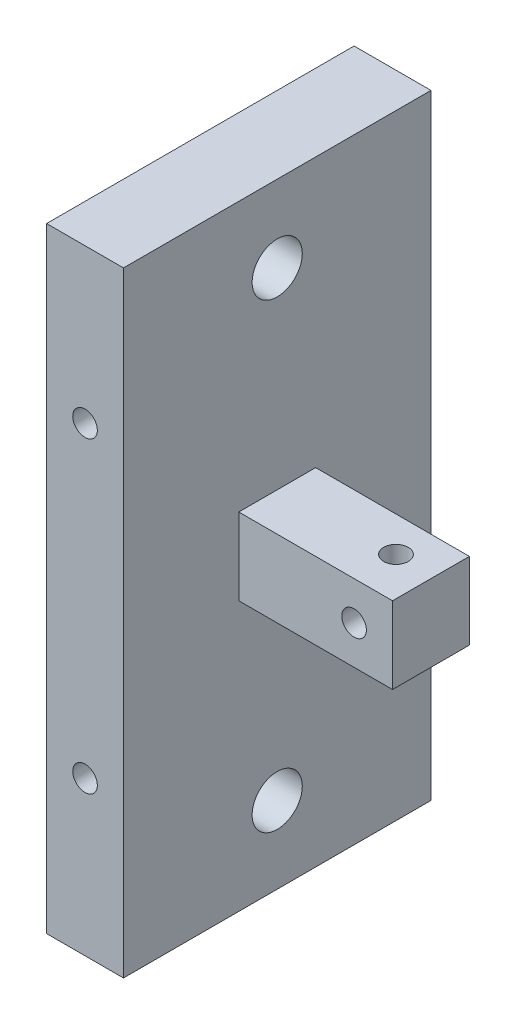
ISO-10303-21;
HEADER;
FILE_DESCRIPTION(('STEP AP214'),'2;1');
FILE_NAME('part.step','',(''),(''),'','','');
FILE_SCHEMA(('AUTOMOTIVE_DESIGN { 1 0 10303 214 1 1 1 1 }'));
ENDSEC;
DATA;
#1=APPLICATION_CONTEXT('core data for automotive mechanical design processes');
#2=APPLICATION_PROTOCOL_DEFINITION('international standard','automotive_design',2000,#1);
#3=PRODUCT_CONTEXT('',#1,'mechanical');
#4=PRODUCT('Part','Part','',(#3));
#5=PRODUCT_RELATED_PRODUCT_CATEGORY('part','',(#4));
#6=PRODUCT_DEFINITION_FORMATION('','',#4);
#7=PRODUCT_DEFINITION_CONTEXT('part definition',#1,'design');
#8=PRODUCT_DEFINITION('design','',#6,#7);
#9=PRODUCT_DEFINITION_SHAPE('','',#8);
#10=(LENGTH_UNIT() NAMED_UNIT(*) SI_UNIT(.MILLI.,.METRE.));
#11=(NAMED_UNIT(*) PLANE_ANGLE_UNIT() SI_UNIT($,.RADIAN.));
#12=(NAMED_UNIT(*) SI_UNIT($,.STERADIAN.) SOLID_ANGLE_UNIT());
#13=UNCERTAINTY_MEASURE_WITH_UNIT(LENGTH_MEASURE(1.E-05),#10,'distance_accuracy_value','');
#14=(GEOMETRIC_REPRESENTATION_CONTEXT(3) GLOBAL_UNCERTAINTY_ASSIGNED_CONTEXT((#13)) GLOBAL_UNIT_ASSIGNED_CONTEXT((#10,
#11,#12)) REPRESENTATION_CONTEXT('',''));
#15=CARTESIAN_POINT('',(0.,0.,0.));
#16=DIRECTION('',(0.,0.,1.));
#17=DIRECTION('',(1.,0.,0.));
#18=AXIS2_PLACEMENT_3D('',#15,#16,#17);
#19=CARTESIAN_POINT('',(25.,721.739130434782,1081.08695652174));
#20=DIRECTION('',(0.,0.,-1.));
#21=DIRECTION('',(-1.,0.,0.));
#22=AXIS2_PLACEMENT_3D('',#19,#20,#21);
#23=CYLINDRICAL_SURFACE('',#22,1.59999999999999);
#24=CARTESIAN_POINT('',(25.,721.739130434782,1081.08695652174));
#25=DIRECTION('',(0.,0.,-1.));
#26=DIRECTION('',(-1.,0.,0.));
#27=AXIS2_PLACEMENT_3D('',#24,#25,#26);
#28=CIRCLE('',#27,1.59999999999999);
#29=CARTESIAN_POINT('',(23.4,721.739130434782,1081.08695652174));
#30=VERTEX_POINT('',#29);
#31=EDGE_CURVE('E243',#30,#30,#28,.T.);
#32=ORIENTED_EDGE('',*,*,#31,.T.);
#33=EDGE_LOOP('',(#32));
#34=FACE_BOUND('',#33,.T.);
#35=CARTESIAN_POINT('',(25.,721.739130434782,1085.63973923246));
#36=DIRECTION('',(0.,-0.707106781186547,-0.707106781186547));
#37=DIRECTION('',(0.,0.707106781186547,-0.707106781186547));
#38=AXIS2_PLACEMENT_3D('',#35,#36,#37);
#39=ELLIPSE('',#38,2.26274169979694,1.59999999999999);
#40=CARTESIAN_POINT('',(26.6,721.739130434782,1085.63973923246));
#41=VERTEX_POINT('',#40);
#42=CARTESIAN_POINT('',(23.4,721.739130434782,1085.63973923246));
#43=VERTEX_POINT('',#42);
#44=EDGE_CURVE('E53',#41,#43,#39,.F.);
#45=ORIENTED_EDGE('',*,*,#44,.T.);
#46=CARTESIAN_POINT('',(25.,721.739130434782,1085.63973923246));
#47=DIRECTION('',(0.,0.707106781186547,-0.707106781186547));
#48=DIRECTION('',(0.,-0.707106781186547,-0.707106781186547));
#49=AXIS2_PLACEMENT_3D('',#46,#47,#48);
#50=ELLIPSE('',#49,2.26274169979694,1.59999999999999);
#51=EDGE_CURVE('E11',#43,#41,#50,.F.);
#52=ORIENTED_EDGE('',*,*,#51,.T.);
#53=EDGE_LOOP('',(#45,#52));
#54=FACE_BOUND('',#53,.T.);
#55=ADVANCED_FACE('F39',(#34,#54),#23,.F.);
#56=CARTESIAN_POINT('',(10.,0.,0.));
#57=DIRECTION('',(1.,0.,0.));
#58=DIRECTION('',(0.,0.,-1.));
#59=AXIS2_PLACEMENT_3D('',#56,#57,#58);
#60=PLANE('',#59);
#61=CARTESIAN_POINT('',(10.,751.739130434783,1086.08695652174));
#62=DIRECTION('',(1.,0.,0.));
#63=DIRECTION('',(0.,0.,-1.));
#64=AXIS2_PLACEMENT_3D('',#61,#62,#63);
#65=CIRCLE('',#64,3.26389999999999);
#66=CARTESIAN_POINT('',(10.,751.739130434783,1082.82305652174));
#67=VERTEX_POINT('',#66);
#68=EDGE_CURVE('E132',#67,#67,#65,.T.);
#69=ORIENTED_EDGE('',*,*,#68,.F.);
#70=EDGE_LOOP('',(#69));
#71=FACE_BOUND('',#70,.T.);
#72=CARTESIAN_POINT('',(10.,691.739130434783,1086.08695652174));
#73=DIRECTION('',(1.,0.,0.));
#74=DIRECTION('',(0.,0.,-1.));
#75=AXIS2_PLACEMENT_3D('',#72,#73,#74);
#76=CIRCLE('',#75,3.26389999999999);
#77=CARTESIAN_POINT('',(10.,691.739130434783,1082.82305652174));
#78=VERTEX_POINT('',#77);
#79=EDGE_CURVE('E131',#78,#78,#76,.T.);
#80=ORIENTED_EDGE('',*,*,#79,.F.);
#81=EDGE_LOOP('',(#80));
#82=FACE_BOUND('',#81,.T.);
#83=DIRECTION('',(0.,-1.,0.));
#84=VECTOR('',#83,1.);
#85=CARTESIAN_POINT('',(10.,761.739130434783,1106.08695652174));
#86=LINE('',#85,#84);
#87=CARTESIAN_POINT('',(10.,761.739130434783,1106.08695652174));
#88=VERTEX_POINT('',#87);
#89=CARTESIAN_POINT('',(10.,681.739130434783,1106.08695652174));
#90=VERTEX_POINT('',#89);
#91=EDGE_CURVE('E152',#88,#90,#86,.T.);
#92=ORIENTED_EDGE('',*,*,#91,.T.);
#93=DIRECTION('',(0.,0.,-1.));
#94=VECTOR('',#93,1.);
#95=CARTESIAN_POINT('',(10.,681.739130434783,1106.08695652174));
#96=LINE('',#95,#94);
#97=CARTESIAN_POINT('',(10.,681.739130434783,1066.08695652174));
#98=VERTEX_POINT('',#97);
#99=EDGE_CURVE('E169',#90,#98,#96,.T.);
#100=ORIENTED_EDGE('',*,*,#99,.T.);
#101=DIRECTION('',(0.,1.,0.));
#102=VECTOR('',#101,1.);
#103=CARTESIAN_POINT('',(10.,761.739130434783,1066.08695652174));
#104=LINE('',#103,#102);
#105=CARTESIAN_POINT('',(10.,761.739130434783,1066.08695652174));
#106=VERTEX_POINT('',#105);
#107=EDGE_CURVE('E166',#98,#106,#104,.T.);
#108=ORIENTED_EDGE('',*,*,#107,.T.);
#109=DIRECTION('',(0.,0.,1.));
#110=VECTOR('',#109,1.);
#111=CARTESIAN_POINT('',(10.,761.739130434783,1106.08695652174));
#112=LINE('',#111,#110);
#113=EDGE_CURVE('E148',#106,#88,#112,.T.);
#114=ORIENTED_EDGE('',*,*,#113,.T.);
#115=EDGE_LOOP('',(#92,#100,#108,#114));
#116=FACE_BOUND('',#115,.T.);
#117=DIRECTION('',(0.,0.,-1.));
#118=VECTOR('',#117,1.);
#119=CARTESIAN_POINT('',(10.,716.739130434782,1091.08695652174));
#120=LINE('',#119,#118);
#121=CARTESIAN_POINT('',(10.,716.739130434782,1091.08695652174));
#122=VERTEX_POINT('',#121);
#123=CARTESIAN_POINT('',(10.,716.739130434782,1081.08695652174));
#124=VERTEX_POINT('',#123);
#125=EDGE_CURVE('E195',#122,#124,#120,.T.);
#126=ORIENTED_EDGE('',*,*,#125,.F.);
#127=DIRECTION('',(0.,-1.,0.));
#128=VECTOR('',#127,1.);
#129=CARTESIAN_POINT('',(10.,726.739130434782,1091.08695652174));
#130=LINE('',#129,#128);
#131=CARTESIAN_POINT('',(10.,726.739130434782,1091.08695652174));
#132=VERTEX_POINT('',#131);
#133=EDGE_CURVE('E198',#132,#122,#130,.T.);
#134=ORIENTED_EDGE('',*,*,#133,.F.);
#135=DIRECTION('',(0.,0.,1.));
#136=VECTOR('',#135,1.);
#137=CARTESIAN_POINT('',(10.,726.739130434782,1091.08695652174));
#138=LINE('',#137,#136);
#139=CARTESIAN_POINT('',(10.,726.739130434782,1081.08695652174));
#140=VERTEX_POINT('',#139);
#141=EDGE_CURVE('E188',#140,#132,#138,.T.);
#142=ORIENTED_EDGE('',*,*,#141,.F.);
#143=DIRECTION('',(0.,1.,0.));
#144=VECTOR('',#143,1.);
#145=CARTESIAN_POINT('',(10.,726.739130434782,1081.08695652174));
#146=LINE('',#145,#144);
#147=EDGE_CURVE('E192',#124,#140,#146,.T.);
#148=ORIENTED_EDGE('',*,*,#147,.F.);
#149=EDGE_LOOP('',(#126,#134,#142,#148));
#150=FACE_BOUND('',#149,.T.);
#151=ADVANCED_FACE('F272',(#71,#82,#116,#150),#60,.T.);
#152=CARTESIAN_POINT('',(10.,761.739130434783,1106.08695652174));
#153=DIRECTION('',(0.,0.,-1.));
#154=DIRECTION('',(-1.,0.,0.));
#155=AXIS2_PLACEMENT_3D('',#152,#153,#154);
#156=PLANE('',#155);
#157=CARTESIAN_POINT('',(5.,701.739130434783,1106.08695652174));
#158=DIRECTION('',(0.,0.,-1.));
#159=DIRECTION('',(-1.,0.,0.));
#160=AXIS2_PLACEMENT_3D('',#157,#158,#159);
#161=CIRCLE('',#160,1.59999999999999);
#162=CARTESIAN_POINT('',(3.40000000000001,701.739130434783,1106.08695652174));
#163=VERTEX_POINT('',#162);
#164=EDGE_CURVE('E231',#163,#163,#161,.T.);
#165=ORIENTED_EDGE('',*,*,#164,.T.);
#166=EDGE_LOOP('',(#165));
#167=FACE_BOUND('',#166,.T.);
#168=CARTESIAN_POINT('',(5.,741.739130434783,1106.08695652174));
#169=DIRECTION('',(0.,0.,-1.));
#170=DIRECTION('',(-1.,0.,0.));
#171=AXIS2_PLACEMENT_3D('',#168,#169,#170);
#172=CIRCLE('',#171,1.59999999999999);
#173=CARTESIAN_POINT('',(3.40000000000001,741.739130434783,1106.08695652174));
#174=VERTEX_POINT('',#173);
#175=EDGE_CURVE('E223',#174,#174,#172,.T.);
#176=ORIENTED_EDGE('',*,*,#175,.T.);
#177=EDGE_LOOP('',(#176));
#178=FACE_BOUND('',#177,.T.);
#179=DIRECTION('',(0.,-1.,0.));
#180=VECTOR('',#179,1.);
#181=CARTESIAN_POINT('',(0.,761.739130434783,1106.08695652174));
#182=LINE('',#181,#180);
#183=CARTESIAN_POINT('',(0.,761.739130434783,1106.08695652174));
#184=VERTEX_POINT('',#183);
#185=CARTESIAN_POINT('',(0.,681.739130434783,1106.08695652174));
#186=VERTEX_POINT('',#185);
#187=EDGE_CURVE('E159',#184,#186,#182,.T.);
#188=ORIENTED_EDGE('',*,*,#187,.T.);
#189=DIRECTION('',(-1.,0.,0.));
#190=VECTOR('',#189,1.);
#191=CARTESIAN_POINT('',(10.,681.739130434783,1106.08695652174));
#192=LINE('',#191,#190);
#193=EDGE_CURVE('E121',#90,#186,#192,.T.);
#194=ORIENTED_EDGE('',*,*,#193,.F.);
#195=ORIENTED_EDGE('',*,*,#91,.F.);
#196=DIRECTION('',(-1.,0.,0.));
#197=VECTOR('',#196,1.);
#198=CARTESIAN_POINT('',(10.,761.739130434783,1106.08695652174));
#199=LINE('',#198,#197);
#200=EDGE_CURVE('E144',#88,#184,#199,.T.);
#201=ORIENTED_EDGE('',*,*,#200,.T.);
#202=EDGE_LOOP('',(#188,#194,#195,#201));
#203=FACE_BOUND('',#202,.T.);
#204=ADVANCED_FACE('F41',(#167,#178,#203),#156,.F.);
#205=CARTESIAN_POINT('',(10.,681.739130434783,1106.08695652174));
#206=DIRECTION('',(0.,1.,0.));
#207=DIRECTION('',(0.,0.,1.));
#208=AXIS2_PLACEMENT_3D('',#205,#206,#207);
#209=PLANE('',#208);
#210=DIRECTION('',(0.,0.,-1.));
#211=VECTOR('',#210,1.);
#212=CARTESIAN_POINT('',(0.,681.739130434783,1106.08695652174));
#213=LINE('',#212,#211);
#214=CARTESIAN_POINT('',(0.,681.739130434783,1066.08695652174));
#215=VERTEX_POINT('',#214);
#216=EDGE_CURVE('E156',#186,#215,#213,.T.);
#217=ORIENTED_EDGE('',*,*,#216,.T.);
#218=DIRECTION('',(-1.,0.,0.));
#219=VECTOR('',#218,1.);
#220=CARTESIAN_POINT('',(10.,681.739130434783,1066.08695652174));
#221=LINE('',#220,#219);
#222=EDGE_CURVE('E136',#98,#215,#221,.T.);
#223=ORIENTED_EDGE('',*,*,#222,.F.);
#224=ORIENTED_EDGE('',*,*,#99,.F.);
#225=ORIENTED_EDGE('',*,*,#193,.T.);
#226=EDGE_LOOP('',(#217,#223,#224,#225));
#227=FACE_BOUND('',#226,.T.);
#228=ADVANCED_FACE('F344',(#227),#209,.F.);
#229=CARTESIAN_POINT('',(10.,761.739130434783,1066.08695652174));
#230=DIRECTION('',(0.,0.,1.));
#231=DIRECTION('',(1.,0.,0.));
#232=AXIS2_PLACEMENT_3D('',#229,#230,#231);
#233=PLANE('',#232);
#234=CARTESIAN_POINT('',(5.,701.739130434783,1066.08695652174));
#235=DIRECTION('',(0.,0.,-1.));
#236=DIRECTION('',(-1.,0.,0.));
#237=AXIS2_PLACEMENT_3D('',#234,#235,#236);
#238=CIRCLE('',#237,1.59999999999999);
#239=CARTESIAN_POINT('',(3.40000000000001,701.739130434783,1066.08695652174));
#240=VERTEX_POINT('',#239);
#241=EDGE_CURVE('E235',#240,#240,#238,.T.);
#242=ORIENTED_EDGE('',*,*,#241,.F.);
#243=EDGE_LOOP('',(#242));
#244=FACE_BOUND('',#243,.T.);
#245=CARTESIAN_POINT('',(5.,741.739130434783,1066.08695652174));
#246=DIRECTION('',(0.,0.,-1.));
#247=DIRECTION('',(-1.,0.,0.));
#248=AXIS2_PLACEMENT_3D('',#245,#246,#247);
#249=CIRCLE('',#248,1.59999999999999);
#250=CARTESIAN_POINT('',(3.40000000000001,741.739130434783,1066.08695652174));
#251=VERTEX_POINT('',#250);
#252=EDGE_CURVE('E227',#251,#251,#249,.T.);
#253=ORIENTED_EDGE('',*,*,#252,.F.);
#254=EDGE_LOOP('',(#253));
#255=FACE_BOUND('',#254,.T.);
#256=DIRECTION('',(0.,1.,0.));
#257=VECTOR('',#256,1.);
#258=CARTESIAN_POINT('',(0.,761.739130434783,1066.08695652174));
#259=LINE('',#258,#257);
#260=CARTESIAN_POINT('',(0.,761.739130434783,1066.08695652174));
#261=VERTEX_POINT('',#260);
#262=EDGE_CURVE('E153',#215,#261,#259,.T.);
#263=ORIENTED_EDGE('',*,*,#262,.T.);
#264=DIRECTION('',(-1.,0.,0.));
#265=VECTOR('',#264,1.);
#266=CARTESIAN_POINT('',(10.,761.739130434783,1066.08695652174));
#267=LINE('',#266,#265);
#268=EDGE_CURVE('E140',#106,#261,#267,.T.);
#269=ORIENTED_EDGE('',*,*,#268,.F.);
#270=ORIENTED_EDGE('',*,*,#107,.F.);
#271=ORIENTED_EDGE('',*,*,#222,.T.);
#272=EDGE_LOOP('',(#263,#269,#270,#271));
#273=FACE_BOUND('',#272,.T.);
#274=ADVANCED_FACE('F341',(#244,#255,#273),#233,.F.);
#275=CARTESIAN_POINT('',(10.,761.739130434783,1106.08695652174));
#276=DIRECTION('',(0.,-1.,0.));
#277=DIRECTION('',(0.,0.,-1.));
#278=AXIS2_PLACEMENT_3D('',#275,#276,#277);
#279=PLANE('',#278);
#280=DIRECTION('',(0.,0.,1.));
#281=VECTOR('',#280,1.);
#282=CARTESIAN_POINT('',(0.,761.739130434783,1106.08695652174));
#283=LINE('',#282,#281);
#284=EDGE_CURVE('E149',#261,#184,#283,.T.);
#285=ORIENTED_EDGE('',*,*,#284,.T.);
#286=ORIENTED_EDGE('',*,*,#200,.F.);
#287=ORIENTED_EDGE('',*,*,#113,.F.);
#288=ORIENTED_EDGE('',*,*,#268,.T.);
#289=EDGE_LOOP('',(#285,#286,#287,#288));
#290=FACE_BOUND('',#289,.T.);
#291=ADVANCED_FACE('F325',(#290),#279,.F.);
#292=CARTESIAN_POINT('',(0.,0.,0.));
#293=DIRECTION('',(1.,0.,0.));
#294=DIRECTION('',(0.,0.,-1.));
#295=AXIS2_PLACEMENT_3D('',#292,#293,#294);
#296=PLANE('',#295);
#297=CARTESIAN_POINT('',(0.,751.739130434783,1086.08695652174));
#298=DIRECTION('',(1.,0.,0.));
#299=DIRECTION('',(0.,0.,-1.));
#300=AXIS2_PLACEMENT_3D('',#297,#298,#299);
#301=CIRCLE('',#300,3.26389999999999);
#302=CARTESIAN_POINT('',(0.,751.739130434783,1082.82305652174));
#303=VERTEX_POINT('',#302);
#304=EDGE_CURVE('E127',#303,#303,#301,.T.);
#305=ORIENTED_EDGE('',*,*,#304,.T.);
#306=EDGE_LOOP('',(#305));
#307=FACE_BOUND('',#306,.T.);
#308=CARTESIAN_POINT('',(0.,691.739130434783,1086.08695652174));
#309=DIRECTION('',(1.,0.,0.));
#310=DIRECTION('',(0.,0.,-1.));
#311=AXIS2_PLACEMENT_3D('',#308,#309,#310);
#312=CIRCLE('',#311,3.26389999999999);
#313=CARTESIAN_POINT('',(0.,691.739130434783,1082.82305652174));
#314=VERTEX_POINT('',#313);
#315=EDGE_CURVE('E202',#314,#314,#312,.T.);
#316=ORIENTED_EDGE('',*,*,#315,.T.);
#317=EDGE_LOOP('',(#316));
#318=FACE_BOUND('',#317,.T.);
#319=ORIENTED_EDGE('',*,*,#187,.F.);
#320=ORIENTED_EDGE('',*,*,#284,.F.);
#321=ORIENTED_EDGE('',*,*,#262,.F.);
#322=ORIENTED_EDGE('',*,*,#216,.F.);
#323=EDGE_LOOP('',(#319,#320,#321,#322));
#324=FACE_BOUND('',#323,.T.);
#325=ADVANCED_FACE('F322',(#307,#318,#324),#296,.F.);
#326=CARTESIAN_POINT('',(30.,726.739130434782,1091.08695652174));
#327=DIRECTION('',(0.,0.,-1.));
#328=DIRECTION('',(-1.,0.,0.));
#329=AXIS2_PLACEMENT_3D('',#326,#327,#328);
#330=PLANE('',#329);
#331=CARTESIAN_POINT('',(25.,721.739130434782,1091.08695652174));
#332=DIRECTION('',(0.,0.,-1.));
#333=DIRECTION('',(-1.,0.,0.));
#334=AXIS2_PLACEMENT_3D('',#331,#332,#333);
#335=CIRCLE('',#334,1.59999999999999);
#336=CARTESIAN_POINT('',(23.4,721.739130434782,1091.08695652174));
#337=VERTEX_POINT('',#336);
#338=EDGE_CURVE('E239',#337,#337,#335,.T.);
#339=ORIENTED_EDGE('',*,*,#338,.T.);
#340=EDGE_LOOP('',(#339));
#341=FACE_BOUND('',#340,.T.);
#342=ORIENTED_EDGE('',*,*,#133,.T.);
#343=DIRECTION('',(-1.,0.,0.));
#344=VECTOR('',#343,1.);
#345=CARTESIAN_POINT('',(30.,716.739130434782,1091.08695652174));
#346=LINE('',#345,#344);
#347=CARTESIAN_POINT('',(30.,716.739130434782,1091.08695652174));
#348=VERTEX_POINT('',#347);
#349=EDGE_CURVE('E163',#348,#122,#346,.T.);
#350=ORIENTED_EDGE('',*,*,#349,.F.);
#351=DIRECTION('',(0.,-1.,0.));
#352=VECTOR('',#351,1.);
#353=CARTESIAN_POINT('',(30.,726.739130434782,1091.08695652174));
#354=LINE('',#353,#352);
#355=CARTESIAN_POINT('',(30.,726.739130434782,1091.08695652174));
#356=VERTEX_POINT('',#355);
#357=EDGE_CURVE('E191',#356,#348,#354,.T.);
#358=ORIENTED_EDGE('',*,*,#357,.F.);
#359=DIRECTION('',(-1.,0.,0.));
#360=VECTOR('',#359,1.);
#361=CARTESIAN_POINT('',(30.,726.739130434782,1091.08695652174));
#362=LINE('',#361,#360);
#363=EDGE_CURVE('E183',#356,#132,#362,.T.);
#364=ORIENTED_EDGE('',*,*,#363,.T.);
#365=EDGE_LOOP('',(#342,#350,#358,#364));
#366=FACE_BOUND('',#365,.T.);
#367=ADVANCED_FACE('F269',(#341,#366),#330,.F.);
#368=CARTESIAN_POINT('',(30.,716.739130434782,1091.08695652174));
#369=DIRECTION('',(0.,1.,0.));
#370=DIRECTION('',(0.,0.,1.));
#371=AXIS2_PLACEMENT_3D('',#368,#369,#370);
#372=PLANE('',#371);
#373=CARTESIAN_POINT('',(25.,716.739130434782,1085.63973923246));
#374=DIRECTION('',(0.,1.,0.));
#375=DIRECTION('',(0.,0.,1.));
#376=AXIS2_PLACEMENT_3D('',#373,#374,#375);
#377=CIRCLE('',#376,1.59999999999999);
#378=CARTESIAN_POINT('',(25.,716.739130434782,1087.23973923246));
#379=VERTEX_POINT('',#378);
#380=EDGE_CURVE('E247',#379,#379,#377,.T.);
#381=ORIENTED_EDGE('',*,*,#380,.T.);
#382=EDGE_LOOP('',(#381));
#383=FACE_BOUND('',#382,.T.);
#384=ORIENTED_EDGE('',*,*,#125,.T.);
#385=DIRECTION('',(-1.,0.,0.));
#386=VECTOR('',#385,1.);
#387=CARTESIAN_POINT('',(30.,716.739130434782,1081.08695652174));
#388=LINE('',#387,#386);
#389=CARTESIAN_POINT('',(30.,716.739130434782,1081.08695652174));
#390=VERTEX_POINT('',#389);
#391=EDGE_CURVE('E177',#390,#124,#388,.T.);
#392=ORIENTED_EDGE('',*,*,#391,.F.);
#393=DIRECTION('',(0.,0.,-1.));
#394=VECTOR('',#393,1.);
#395=CARTESIAN_POINT('',(30.,716.739130434782,1091.08695652174));
#396=LINE('',#395,#394);
#397=EDGE_CURVE('E208',#348,#390,#396,.T.);
#398=ORIENTED_EDGE('',*,*,#397,.F.);
#399=ORIENTED_EDGE('',*,*,#349,.T.);
#400=EDGE_LOOP('',(#384,#392,#398,#399));
#401=FACE_BOUND('',#400,.T.);
#402=ADVANCED_FACE('F275',(#383,#401),#372,.F.);
#403=CARTESIAN_POINT('',(30.,726.739130434782,1081.08695652174));
#404=DIRECTION('',(0.,0.,1.));
#405=DIRECTION('',(1.,0.,0.));
#406=AXIS2_PLACEMENT_3D('',#403,#404,#405);
#407=PLANE('',#406);
#408=ORIENTED_EDGE('',*,*,#31,.F.);
#409=EDGE_LOOP('',(#408));
#410=FACE_BOUND('',#409,.T.);
#411=ORIENTED_EDGE('',*,*,#147,.T.);
#412=DIRECTION('',(-1.,0.,0.));
#413=VECTOR('',#412,1.);
#414=CARTESIAN_POINT('',(30.,726.739130434782,1081.08695652174));
#415=LINE('',#414,#413);
#416=CARTESIAN_POINT('',(30.,726.739130434782,1081.08695652174));
#417=VERTEX_POINT('',#416);
#418=EDGE_CURVE('E61',#417,#140,#415,.T.);
#419=ORIENTED_EDGE('',*,*,#418,.F.);
#420=DIRECTION('',(0.,1.,0.));
#421=VECTOR('',#420,1.);
#422=CARTESIAN_POINT('',(30.,726.739130434782,1081.08695652174));
#423=LINE('',#422,#421);
#424=EDGE_CURVE('E205',#390,#417,#423,.T.);
#425=ORIENTED_EDGE('',*,*,#424,.F.);
#426=ORIENTED_EDGE('',*,*,#391,.T.);
#427=EDGE_LOOP('',(#411,#419,#425,#426));
#428=FACE_BOUND('',#427,.T.);
#429=ADVANCED_FACE('F260',(#410,#428),#407,.F.);
#430=CARTESIAN_POINT('',(30.,726.739130434782,1091.08695652174));
#431=DIRECTION('',(0.,-1.,0.));
#432=DIRECTION('',(0.,0.,-1.));
#433=AXIS2_PLACEMENT_3D('',#430,#431,#432);
#434=PLANE('',#433);
#435=CARTESIAN_POINT('',(25.,726.739130434782,1085.63973923246));
#436=DIRECTION('',(0.,1.,0.));
#437=DIRECTION('',(0.,0.,1.));
#438=AXIS2_PLACEMENT_3D('',#435,#436,#437);
#439=CIRCLE('',#438,1.59999999999999);
#440=CARTESIAN_POINT('',(25.,726.739130434782,1087.23973923246));
#441=VERTEX_POINT('',#440);
#442=EDGE_CURVE('E251',#441,#441,#439,.T.);
#443=ORIENTED_EDGE('',*,*,#442,.F.);
#444=EDGE_LOOP('',(#443));
#445=FACE_BOUND('',#444,.T.);
#446=ORIENTED_EDGE('',*,*,#141,.T.);
#447=ORIENTED_EDGE('',*,*,#363,.F.);
#448=DIRECTION('',(0.,0.,1.));
#449=VECTOR('',#448,1.);
#450=CARTESIAN_POINT('',(30.,726.739130434782,1091.08695652174));
#451=LINE('',#450,#449);
#452=EDGE_CURVE('E187',#417,#356,#451,.T.);
#453=ORIENTED_EDGE('',*,*,#452,.F.);
#454=ORIENTED_EDGE('',*,*,#418,.T.);
#455=EDGE_LOOP('',(#446,#447,#453,#454));
#456=FACE_BOUND('',#455,.T.);
#457=ADVANCED_FACE('F257',(#445,#456),#434,.F.);
#458=CARTESIAN_POINT('',(30.,0.,0.));
#459=DIRECTION('',(1.,0.,0.));
#460=DIRECTION('',(0.,0.,-1.));
#461=AXIS2_PLACEMENT_3D('',#458,#459,#460);
#462=PLANE('',#461);
#463=ORIENTED_EDGE('',*,*,#357,.T.);
#464=ORIENTED_EDGE('',*,*,#397,.T.);
#465=ORIENTED_EDGE('',*,*,#424,.T.);
#466=ORIENTED_EDGE('',*,*,#452,.T.);
#467=EDGE_LOOP('',(#463,#464,#465,#466));
#468=FACE_BOUND('',#467,.T.);
#469=ADVANCED_FACE('F259',(#468),#462,.T.);
#470=CARTESIAN_POINT('',(10.,691.739130434783,1086.08695652174));
#471=DIRECTION('',(1.,0.,0.));
#472=DIRECTION('',(0.,0.,-1.));
#473=AXIS2_PLACEMENT_3D('',#470,#471,#472);
#474=CYLINDRICAL_SURFACE('',#473,3.26389999999999);
#475=ORIENTED_EDGE('',*,*,#79,.T.);
#476=EDGE_LOOP('',(#475));
#477=FACE_BOUND('',#476,.T.);
#478=ORIENTED_EDGE('',*,*,#315,.F.);
#479=EDGE_LOOP('',(#478));
#480=FACE_BOUND('',#479,.T.);
#481=ADVANCED_FACE('F280',(#477,#480),#474,.F.);
#482=CARTESIAN_POINT('',(10.,751.739130434783,1086.08695652174));
#483=DIRECTION('',(1.,0.,0.));
#484=DIRECTION('',(0.,0.,-1.));
#485=AXIS2_PLACEMENT_3D('',#482,#483,#484);
#486=CYLINDRICAL_SURFACE('',#485,3.26389999999999);
#487=ORIENTED_EDGE('',*,*,#68,.T.);
#488=EDGE_LOOP('',(#487));
#489=FACE_BOUND('',#488,.T.);
#490=ORIENTED_EDGE('',*,*,#304,.F.);
#491=EDGE_LOOP('',(#490));
#492=FACE_BOUND('',#491,.T.);
#493=ADVANCED_FACE('F285',(#489,#492),#486,.F.);
#494=CARTESIAN_POINT('',(5.,741.739130434783,1066.08695652174));
#495=DIRECTION('',(0.,0.,-1.));
#496=DIRECTION('',(-1.,0.,0.));
#497=AXIS2_PLACEMENT_3D('',#494,#495,#496);
#498=CYLINDRICAL_SURFACE('',#497,1.59999999999999);
#499=ORIENTED_EDGE('',*,*,#175,.F.);
#500=EDGE_LOOP('',(#499));
#501=FACE_BOUND('',#500,.T.);
#502=ORIENTED_EDGE('',*,*,#252,.T.);
#503=EDGE_LOOP('',(#502));
#504=FACE_BOUND('',#503,.T.);
#505=ADVANCED_FACE('F304',(#501,#504),#498,.F.);
#506=CARTESIAN_POINT('',(5.,701.739130434783,1066.08695652174));
#507=DIRECTION('',(0.,0.,-1.));
#508=DIRECTION('',(-1.,0.,0.));
#509=AXIS2_PLACEMENT_3D('',#506,#507,#508);
#510=CYLINDRICAL_SURFACE('',#509,1.59999999999999);
#511=ORIENTED_EDGE('',*,*,#164,.F.);
#512=EDGE_LOOP('',(#511));
#513=FACE_BOUND('',#512,.T.);
#514=ORIENTED_EDGE('',*,*,#241,.T.);
#515=EDGE_LOOP('',(#514));
#516=FACE_BOUND('',#515,.T.);
#517=ADVANCED_FACE('F299',(#513,#516),#510,.F.);
#518=CARTESIAN_POINT('',(25.,721.739130434782,1085.63973923246));
#519=DIRECTION('',(0.,-0.707106781186547,-0.707106781186547));
#520=DIRECTION('',(0.,0.707106781186547,-0.707106781186547));
#521=AXIS2_PLACEMENT_3D('',#518,#519,#520);
#522=ELLIPSE('',#521,2.26274169979694,1.59999999999999);
#523=EDGE_CURVE('E112',#41,#43,#522,.T.);
#524=ORIENTED_EDGE('',*,*,#523,.T.);
#525=CARTESIAN_POINT('',(25.,721.739130434782,1085.63973923246));
#526=DIRECTION('',(0.,0.707106781186547,-0.707106781186547));
#527=DIRECTION('',(0.,-0.707106781186547,-0.707106781186547));
#528=AXIS2_PLACEMENT_3D('',#525,#526,#527);
#529=ELLIPSE('',#528,2.26274169979694,1.59999999999999);
#530=EDGE_CURVE('E48',#43,#41,#529,.T.);
#531=ORIENTED_EDGE('',*,*,#530,.T.);
#532=EDGE_LOOP('',(#524,#531));
#533=FACE_BOUND('',#532,.T.);
#534=ORIENTED_EDGE('',*,*,#338,.F.);
#535=EDGE_LOOP('',(#534));
#536=FACE_BOUND('',#535,.T.);
#537=ADVANCED_FACE('F123',(#533,#536),#23,.F.);
#538=CARTESIAN_POINT('',(25.,726.739130434782,1085.63973923246));
#539=DIRECTION('',(0.,1.,0.));
#540=DIRECTION('',(0.,0.,1.));
#541=AXIS2_PLACEMENT_3D('',#538,#539,#540);
#542=CYLINDRICAL_SURFACE('',#541,1.59999999999999);
#543=ORIENTED_EDGE('',*,*,#442,.T.);
#544=EDGE_LOOP('',(#543));
#545=FACE_BOUND('',#544,.T.);
#546=ORIENTED_EDGE('',*,*,#44,.F.);
#547=ORIENTED_EDGE('',*,*,#530,.F.);
#548=EDGE_LOOP('',(#546,#547));
#549=FACE_BOUND('',#548,.T.);
#550=ADVANCED_FACE('F119',(#545,#549),#542,.F.);
#551=ORIENTED_EDGE('',*,*,#380,.F.);
#552=EDGE_LOOP('',(#551));
#553=FACE_BOUND('',#552,.T.);
#554=ORIENTED_EDGE('',*,*,#523,.F.);
#555=ORIENTED_EDGE('',*,*,#51,.F.);
#556=EDGE_LOOP('',(#554,#555));
#557=FACE_BOUND('',#556,.T.);
#558=ADVANCED_FACE('F113',(#553,#557),#542,.F.);
#559=CLOSED_SHELL('',(#55,#151,#204,#228,#274,#291,#325,#367,#402,#429,#457,#469,#481,#493,#505,
#517,#537,#550,#558));
#560=MANIFOLD_SOLID_BREP('B2',#559);
#561=ADVANCED_BREP_SHAPE_REPRESENTATION('',(#18,#560),#14);
#562=SHAPE_DEFINITION_REPRESENTATION(#9,#561);
ENDSEC;
END-ISO-10303-21;
